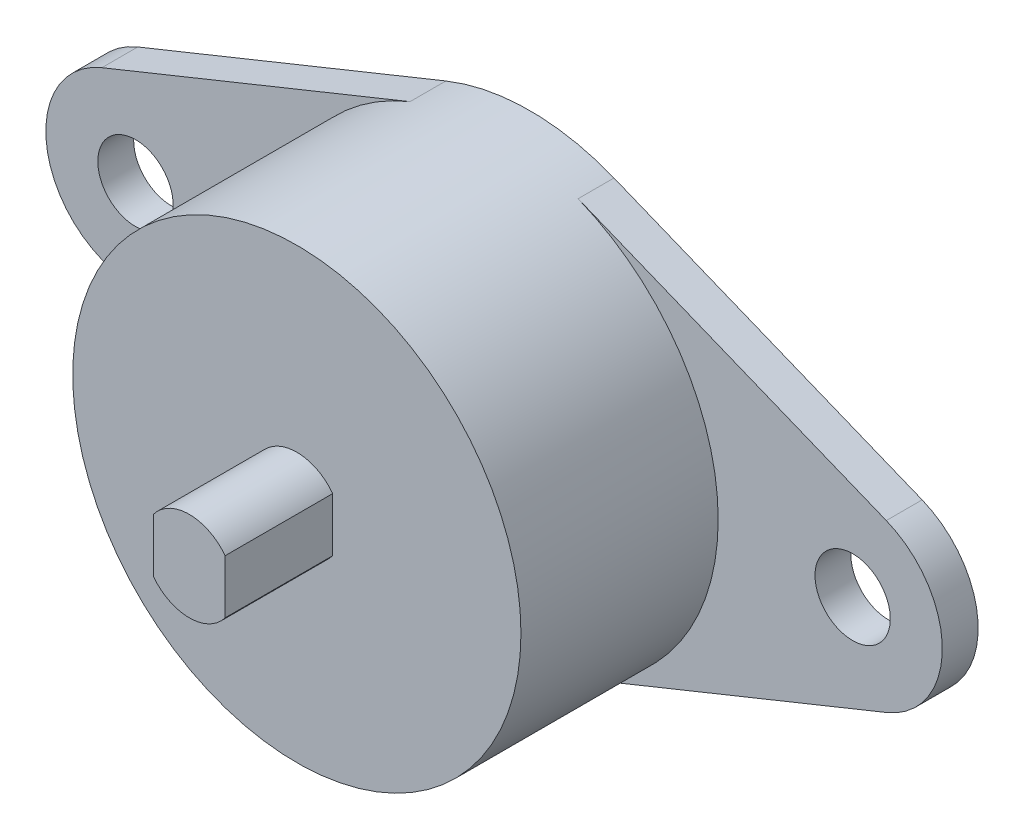
ISO-10303-21;
HEADER;
FILE_DESCRIPTION(('STEP AP214'),'2;1');
FILE_NAME('part.step','',(''),(''),'','','');
FILE_SCHEMA(('AUTOMOTIVE_DESIGN { 1 0 10303 214 1 1 1 1 }'));
ENDSEC;
DATA;
#1=APPLICATION_CONTEXT('core data for automotive mechanical design processes');
#2=APPLICATION_PROTOCOL_DEFINITION('international standard','automotive_design',2000,#1);
#3=PRODUCT_CONTEXT('',#1,'mechanical');
#4=PRODUCT('Part','Part','',(#3));
#5=PRODUCT_RELATED_PRODUCT_CATEGORY('part','',(#4));
#6=PRODUCT_DEFINITION_FORMATION('','',#4);
#7=PRODUCT_DEFINITION_CONTEXT('part definition',#1,'design');
#8=PRODUCT_DEFINITION('design','',#6,#7);
#9=PRODUCT_DEFINITION_SHAPE('','',#8);
#10=(LENGTH_UNIT() NAMED_UNIT(*) SI_UNIT(.MILLI.,.METRE.));
#11=(NAMED_UNIT(*) PLANE_ANGLE_UNIT() SI_UNIT($,.RADIAN.));
#12=(NAMED_UNIT(*) SI_UNIT($,.STERADIAN.) SOLID_ANGLE_UNIT());
#13=UNCERTAINTY_MEASURE_WITH_UNIT(LENGTH_MEASURE(1.E-05),#10,'distance_accuracy_value','');
#14=(GEOMETRIC_REPRESENTATION_CONTEXT(3) GLOBAL_UNCERTAINTY_ASSIGNED_CONTEXT((#13)) GLOBAL_UNIT_ASSIGNED_CONTEXT((#10,
#11,#12)) REPRESENTATION_CONTEXT('',''));
#15=CARTESIAN_POINT('',(0.,0.,0.));
#16=DIRECTION('',(0.,0.,1.));
#17=DIRECTION('',(1.,0.,0.));
#18=AXIS2_PLACEMENT_3D('',#15,#16,#17);
#19=CARTESIAN_POINT('',(0.,0.,19.));
#20=DIRECTION('',(0.,0.,-1.));
#21=DIRECTION('',(-1.,0.,0.));
#22=AXIS2_PLACEMENT_3D('',#19,#20,#21);
#23=PLANE('',#22);
#24=DIRECTION('',(0.,1.,0.));
#25=VECTOR('',#24,1.);
#26=CARTESIAN_POINT('',(-2.,1.50000000000003,19.));
#27=LINE('',#26,#25);
#28=CARTESIAN_POINT('',(-1.99999999999999,-1.50000000000001,19.));
#29=VERTEX_POINT('',#28);
#30=CARTESIAN_POINT('',(-1.99999999999999,1.50000000000001,19.));
#31=VERTEX_POINT('',#30);
#32=EDGE_CURVE('E119',#29,#31,#27,.T.);
#33=ORIENTED_EDGE('',*,*,#32,.F.);
#34=CARTESIAN_POINT('',(0.,0.,19.));
#35=DIRECTION('',(0.,0.,1.));
#36=DIRECTION('',(1.,0.,0.));
#37=AXIS2_PLACEMENT_3D('',#34,#35,#36);
#38=CIRCLE('',#37,2.5);
#39=CARTESIAN_POINT('',(1.99999999999999,-1.50000000000001,19.));
#40=VERTEX_POINT('',#39);
#41=EDGE_CURVE('E107',#40,#29,#38,.F.);
#42=ORIENTED_EDGE('',*,*,#41,.F.);
#43=DIRECTION('',(0.,1.,0.));
#44=VECTOR('',#43,1.);
#45=CARTESIAN_POINT('',(2.,-1.50000000000003,19.));
#46=LINE('',#45,#44);
#47=CARTESIAN_POINT('',(2.,1.50000000000001,19.));
#48=VERTEX_POINT('',#47);
#49=EDGE_CURVE('E105',#48,#40,#46,.F.);
#50=ORIENTED_EDGE('',*,*,#49,.F.);
#51=CARTESIAN_POINT('',(0.,0.,19.));
#52=DIRECTION('',(0.,0.,1.));
#53=DIRECTION('',(1.,0.,0.));
#54=AXIS2_PLACEMENT_3D('',#51,#52,#53);
#55=CIRCLE('',#54,2.5);
#56=EDGE_CURVE('E20',#31,#48,#55,.F.);
#57=ORIENTED_EDGE('',*,*,#56,.F.);
#58=EDGE_LOOP('',(#33,#42,#50,#57));
#59=FACE_BOUND('',#58,.T.);
#60=ADVANCED_FACE('F17',(#59),#23,.F.);
#61=CARTESIAN_POINT('',(-2.,1.50000000000003,13.));
#62=DIRECTION('',(-1.,0.,0.));
#63=DIRECTION('',(0.,0.,1.));
#64=AXIS2_PLACEMENT_3D('',#61,#62,#63);
#65=PLANE('',#64);
#66=DIRECTION('',(0.,1.,0.));
#67=VECTOR('',#66,1.);
#68=CARTESIAN_POINT('',(-2.,0.,13.));
#69=LINE('',#68,#67);
#70=CARTESIAN_POINT('',(-1.99999999999999,-1.50000000000001,13.));
#71=VERTEX_POINT('',#70);
#72=CARTESIAN_POINT('',(-1.99999999999999,1.50000000000001,13.));
#73=VERTEX_POINT('',#72);
#74=EDGE_CURVE('E180',#71,#73,#69,.T.);
#75=ORIENTED_EDGE('',*,*,#74,.F.);
#76=DIRECTION('',(0.,0.,1.));
#77=VECTOR('',#76,1.);
#78=CARTESIAN_POINT('',(-1.99999999999999,-1.50000000000002,13.));
#79=LINE('',#78,#77);
#80=EDGE_CURVE('E125',#29,#71,#79,.F.);
#81=ORIENTED_EDGE('',*,*,#80,.F.);
#82=ORIENTED_EDGE('',*,*,#32,.T.);
#83=DIRECTION('',(0.,0.,1.));
#84=VECTOR('',#83,1.);
#85=CARTESIAN_POINT('',(-1.99999999999999,1.50000000000002,13.));
#86=LINE('',#85,#84);
#87=EDGE_CURVE('E112',#73,#31,#86,.T.);
#88=ORIENTED_EDGE('',*,*,#87,.F.);
#89=EDGE_LOOP('',(#75,#81,#82,#88));
#90=FACE_BOUND('',#89,.T.);
#91=ADVANCED_FACE('F263',(#90),#65,.T.);
#92=CARTESIAN_POINT('',(0.,0.,13.));
#93=DIRECTION('',(0.,0.,1.));
#94=DIRECTION('',(1.,0.,0.));
#95=AXIS2_PLACEMENT_3D('',#92,#93,#94);
#96=CYLINDRICAL_SURFACE('',#95,2.5);
#97=CARTESIAN_POINT('',(0.,0.,13.));
#98=DIRECTION('',(0.,0.,1.));
#99=DIRECTION('',(1.,0.,0.));
#100=AXIS2_PLACEMENT_3D('',#97,#98,#99);
#101=CIRCLE('',#100,2.5);
#102=CARTESIAN_POINT('',(2.,1.50000000000001,13.));
#103=VERTEX_POINT('',#102);
#104=EDGE_CURVE('E179',#73,#103,#101,.F.);
#105=ORIENTED_EDGE('',*,*,#104,.F.);
#106=ORIENTED_EDGE('',*,*,#87,.T.);
#107=ORIENTED_EDGE('',*,*,#56,.T.);
#108=DIRECTION('',(0.,0.,-1.));
#109=VECTOR('',#108,1.);
#110=CARTESIAN_POINT('',(2.,1.50000000000003,13.));
#111=LINE('',#110,#109);
#112=EDGE_CURVE('E111',#103,#48,#111,.F.);
#113=ORIENTED_EDGE('',*,*,#112,.F.);
#114=EDGE_LOOP('',(#105,#106,#107,#113));
#115=FACE_BOUND('',#114,.T.);
#116=ADVANCED_FACE('F117',(#115),#96,.T.);
#117=CARTESIAN_POINT('',(2.,-1.50000000000003,13.));
#118=DIRECTION('',(1.,0.,0.));
#119=DIRECTION('',(0.,0.,-1.));
#120=AXIS2_PLACEMENT_3D('',#117,#118,#119);
#121=PLANE('',#120);
#122=DIRECTION('',(0.,1.,0.));
#123=VECTOR('',#122,1.);
#124=CARTESIAN_POINT('',(2.,0.,13.));
#125=LINE('',#124,#123);
#126=CARTESIAN_POINT('',(1.99999999999999,-1.50000000000001,13.));
#127=VERTEX_POINT('',#126);
#128=EDGE_CURVE('E122',#103,#127,#125,.F.);
#129=ORIENTED_EDGE('',*,*,#128,.F.);
#130=ORIENTED_EDGE('',*,*,#112,.T.);
#131=ORIENTED_EDGE('',*,*,#49,.T.);
#132=DIRECTION('',(0.,0.,1.));
#133=VECTOR('',#132,1.);
#134=CARTESIAN_POINT('',(1.99999999999999,-1.50000000000002,13.));
#135=LINE('',#134,#133);
#136=EDGE_CURVE('E128',#127,#40,#135,.T.);
#137=ORIENTED_EDGE('',*,*,#136,.F.);
#138=EDGE_LOOP('',(#129,#130,#131,#137));
#139=FACE_BOUND('',#138,.T.);
#140=ADVANCED_FACE('F120',(#139),#121,.T.);
#141=CARTESIAN_POINT('',(0.,0.,13.));
#142=DIRECTION('',(0.,0.,1.));
#143=DIRECTION('',(1.,0.,0.));
#144=AXIS2_PLACEMENT_3D('',#141,#142,#143);
#145=CYLINDRICAL_SURFACE('',#144,2.5);
#146=CARTESIAN_POINT('',(0.,0.,13.));
#147=DIRECTION('',(0.,0.,1.));
#148=DIRECTION('',(1.,0.,0.));
#149=AXIS2_PLACEMENT_3D('',#146,#147,#148);
#150=CIRCLE('',#149,2.5);
#151=EDGE_CURVE('E175',#127,#71,#150,.F.);
#152=ORIENTED_EDGE('',*,*,#151,.F.);
#153=ORIENTED_EDGE('',*,*,#136,.T.);
#154=ORIENTED_EDGE('',*,*,#41,.T.);
#155=ORIENTED_EDGE('',*,*,#80,.T.);
#156=EDGE_LOOP('',(#152,#153,#154,#155));
#157=FACE_BOUND('',#156,.T.);
#158=ADVANCED_FACE('F199',(#157),#145,.T.);
#159=CARTESIAN_POINT('',(20.,0.,0.));
#160=DIRECTION('',(0.,0.,1.));
#161=DIRECTION('',(1.,0.,0.));
#162=AXIS2_PLACEMENT_3D('',#159,#160,#161);
#163=CYLINDRICAL_SURFACE('',#162,4.99999999999999);
#164=CARTESIAN_POINT('',(20.,0.,2.));
#165=DIRECTION('',(0.,0.,1.));
#166=DIRECTION('',(1.,0.,0.));
#167=AXIS2_PLACEMENT_3D('',#164,#165,#166);
#168=CIRCLE('',#167,4.99999999999999);
#169=CARTESIAN_POINT('',(21.875,-4.63512405443479,2.));
#170=VERTEX_POINT('',#169);
#171=CARTESIAN_POINT('',(21.875,4.6351240544348,2.));
#172=VERTEX_POINT('',#171);
#173=EDGE_CURVE('E172',#170,#172,#168,.T.);
#174=ORIENTED_EDGE('',*,*,#173,.F.);
#175=DIRECTION('',(0.,0.,1.));
#176=VECTOR('',#175,1.);
#177=CARTESIAN_POINT('',(21.875,-4.63512405443478,0.));
#178=LINE('',#177,#176);
#179=CARTESIAN_POINT('',(21.875,-4.63512405443479,0.));
#180=VERTEX_POINT('',#179);
#181=EDGE_CURVE('E188',#180,#170,#178,.T.);
#182=ORIENTED_EDGE('',*,*,#181,.F.);
#183=CARTESIAN_POINT('',(20.,0.,0.));
#184=DIRECTION('',(0.,0.,1.));
#185=DIRECTION('',(1.,0.,0.));
#186=AXIS2_PLACEMENT_3D('',#183,#184,#185);
#187=CIRCLE('',#186,4.99999999999999);
#188=CARTESIAN_POINT('',(21.875,4.6351240544348,0.));
#189=VERTEX_POINT('',#188);
#190=EDGE_CURVE('E165',#180,#189,#187,.T.);
#191=ORIENTED_EDGE('',*,*,#190,.T.);
#192=DIRECTION('',(0.,0.,1.));
#193=VECTOR('',#192,1.);
#194=CARTESIAN_POINT('',(21.875,4.6351240544348,0.));
#195=LINE('',#194,#193);
#196=EDGE_CURVE('E191',#172,#189,#195,.F.);
#197=ORIENTED_EDGE('',*,*,#196,.F.);
#198=EDGE_LOOP('',(#174,#182,#191,#197));
#199=FACE_BOUND('',#198,.T.);
#200=ADVANCED_FACE('F253',(#199),#163,.T.);
#201=CARTESIAN_POINT('',(20.,0.,0.899999999999999));
#202=DIRECTION('',(0.,0.,-1.));
#203=DIRECTION('',(-1.,0.,0.));
#204=AXIS2_PLACEMENT_3D('',#201,#202,#203);
#205=CYLINDRICAL_SURFACE('',#204,2.1);
#206=CARTESIAN_POINT('',(20.,0.,0.));
#207=DIRECTION('',(0.,0.,-1.));
#208=DIRECTION('',(-1.,0.,0.));
#209=AXIS2_PLACEMENT_3D('',#206,#207,#208);
#210=CIRCLE('',#209,2.1);
#211=CARTESIAN_POINT('',(17.9,0.,0.));
#212=VERTEX_POINT('',#211);
#213=EDGE_CURVE('E154',#212,#212,#210,.T.);
#214=ORIENTED_EDGE('',*,*,#213,.T.);
#215=EDGE_LOOP('',(#214));
#216=FACE_BOUND('',#215,.T.);
#217=CARTESIAN_POINT('',(20.,0.,2.));
#218=DIRECTION('',(0.,0.,-1.));
#219=DIRECTION('',(-1.,0.,0.));
#220=AXIS2_PLACEMENT_3D('',#217,#218,#219);
#221=CIRCLE('',#220,2.1);
#222=CARTESIAN_POINT('',(17.9,0.,2.));
#223=VERTEX_POINT('',#222);
#224=EDGE_CURVE('E168',#223,#223,#221,.T.);
#225=ORIENTED_EDGE('',*,*,#224,.F.);
#226=EDGE_LOOP('',(#225));
#227=FACE_BOUND('',#226,.T.);
#228=ADVANCED_FACE('F249',(#216,#227),#205,.F.);
#229=CARTESIAN_POINT('',(-20.,0.,0.));
#230=DIRECTION('',(0.,0.,1.));
#231=DIRECTION('',(1.,0.,0.));
#232=AXIS2_PLACEMENT_3D('',#229,#230,#231);
#233=CYLINDRICAL_SURFACE('',#232,4.99999999999999);
#234=CARTESIAN_POINT('',(-20.,0.,2.));
#235=DIRECTION('',(0.,0.,1.));
#236=DIRECTION('',(1.,0.,0.));
#237=AXIS2_PLACEMENT_3D('',#234,#235,#236);
#238=CIRCLE('',#237,4.99999999999999);
#239=CARTESIAN_POINT('',(-21.875,4.63512405443479,2.));
#240=VERTEX_POINT('',#239);
#241=CARTESIAN_POINT('',(-21.875,-4.63512405443477,2.));
#242=VERTEX_POINT('',#241);
#243=EDGE_CURVE('E151',#240,#242,#238,.T.);
#244=ORIENTED_EDGE('',*,*,#243,.F.);
#245=DIRECTION('',(0.,0.,1.));
#246=VECTOR('',#245,1.);
#247=CARTESIAN_POINT('',(-21.875,4.63512405443478,0.));
#248=LINE('',#247,#246);
#249=CARTESIAN_POINT('',(-21.875,4.63512405443478,0.));
#250=VERTEX_POINT('',#249);
#251=EDGE_CURVE('E189',#250,#240,#248,.T.);
#252=ORIENTED_EDGE('',*,*,#251,.F.);
#253=CARTESIAN_POINT('',(-20.,0.,0.));
#254=DIRECTION('',(0.,0.,1.));
#255=DIRECTION('',(1.,0.,0.));
#256=AXIS2_PLACEMENT_3D('',#253,#254,#255);
#257=CIRCLE('',#256,4.99999999999999);
#258=CARTESIAN_POINT('',(-21.875,-4.63512405443477,0.));
#259=VERTEX_POINT('',#258);
#260=EDGE_CURVE('E161',#250,#259,#257,.T.);
#261=ORIENTED_EDGE('',*,*,#260,.T.);
#262=DIRECTION('',(0.,0.,1.));
#263=VECTOR('',#262,1.);
#264=CARTESIAN_POINT('',(-21.875,-4.63512405443477,0.));
#265=LINE('',#264,#263);
#266=EDGE_CURVE('E178',#242,#259,#265,.F.);
#267=ORIENTED_EDGE('',*,*,#266,.F.);
#268=EDGE_LOOP('',(#244,#252,#261,#267));
#269=FACE_BOUND('',#268,.T.);
#270=ADVANCED_FACE('F245',(#269),#233,.T.);
#271=CARTESIAN_POINT('',(-20.,0.,0.899999999999999));
#272=DIRECTION('',(0.,0.,-1.));
#273=DIRECTION('',(-1.,0.,0.));
#274=AXIS2_PLACEMENT_3D('',#271,#272,#273);
#275=CYLINDRICAL_SURFACE('',#274,2.1);
#276=CARTESIAN_POINT('',(-20.,0.,0.));
#277=DIRECTION('',(0.,0.,-1.));
#278=DIRECTION('',(-1.,0.,0.));
#279=AXIS2_PLACEMENT_3D('',#276,#277,#278);
#280=CIRCLE('',#279,2.1);
#281=CARTESIAN_POINT('',(-22.1,0.,0.));
#282=VERTEX_POINT('',#281);
#283=EDGE_CURVE('E158',#282,#282,#280,.T.);
#284=ORIENTED_EDGE('',*,*,#283,.T.);
#285=EDGE_LOOP('',(#284));
#286=FACE_BOUND('',#285,.T.);
#287=CARTESIAN_POINT('',(-20.,0.,2.));
#288=DIRECTION('',(0.,0.,-1.));
#289=DIRECTION('',(-1.,0.,0.));
#290=AXIS2_PLACEMENT_3D('',#287,#288,#289);
#291=CIRCLE('',#290,2.1);
#292=CARTESIAN_POINT('',(-22.1,0.,2.));
#293=VERTEX_POINT('',#292);
#294=EDGE_CURVE('E147',#293,#293,#291,.T.);
#295=ORIENTED_EDGE('',*,*,#294,.F.);
#296=EDGE_LOOP('',(#295));
#297=FACE_BOUND('',#296,.T.);
#298=ADVANCED_FACE('F205',(#286,#297),#275,.F.);
#299=CARTESIAN_POINT('',(0.,0.,13.));
#300=DIRECTION('',(0.,0.,1.));
#301=DIRECTION('',(1.,0.,0.));
#302=AXIS2_PLACEMENT_3D('',#299,#300,#301);
#303=PLANE('',#302);
#304=ORIENTED_EDGE('',*,*,#128,.T.);
#305=ORIENTED_EDGE('',*,*,#151,.T.);
#306=ORIENTED_EDGE('',*,*,#74,.T.);
#307=ORIENTED_EDGE('',*,*,#104,.T.);
#308=EDGE_LOOP('',(#304,#305,#306,#307));
#309=FACE_BOUND('',#308,.T.);
#310=CARTESIAN_POINT('',(0.,0.,13.));
#311=DIRECTION('',(0.,0.,1.));
#312=DIRECTION('',(1.,0.,0.));
#313=AXIS2_PLACEMENT_3D('',#310,#311,#312);
#314=CIRCLE('',#313,12.5);
#315=CARTESIAN_POINT('',(12.5,0.,13.));
#316=VERTEX_POINT('',#315);
#317=EDGE_CURVE('E144',#316,#316,#314,.F.);
#318=ORIENTED_EDGE('',*,*,#317,.F.);
#319=EDGE_LOOP('',(#318));
#320=FACE_BOUND('',#319,.T.);
#321=ADVANCED_FACE('F201',(#309,#320),#303,.T.);
#322=CARTESIAN_POINT('',(-21.875,-4.63512405443477,0.));
#323=DIRECTION('',(-0.375,-0.927024810886958,0.));
#324=DIRECTION('',(0.927024810886958,-0.375,0.));
#325=AXIS2_PLACEMENT_3D('',#322,#323,#324);
#326=PLANE('',#325);
#327=DIRECTION('',(0.927024810886958,-0.375,0.));
#328=VECTOR('',#327,1.);
#329=CARTESIAN_POINT('',(-21.875,-4.63512405443477,2.));
#330=LINE('',#329,#328);
#331=CARTESIAN_POINT('',(-4.6875,-11.587810136087,2.));
#332=VERTEX_POINT('',#331);
#333=EDGE_CURVE('E150',#242,#332,#330,.T.);
#334=ORIENTED_EDGE('',*,*,#333,.F.);
#335=ORIENTED_EDGE('',*,*,#266,.T.);
#336=DIRECTION('',(0.927024810886958,-0.375,0.));
#337=VECTOR('',#336,1.);
#338=CARTESIAN_POINT('',(-21.875,-4.63512405443477,0.));
#339=LINE('',#338,#337);
#340=CARTESIAN_POINT('',(-4.6875,-11.587810136087,0.));
#341=VERTEX_POINT('',#340);
#342=EDGE_CURVE('E194',#259,#341,#339,.T.);
#343=ORIENTED_EDGE('',*,*,#342,.T.);
#344=DIRECTION('',(0.,0.,1.));
#345=VECTOR('',#344,1.);
#346=CARTESIAN_POINT('',(-4.68750000000001,-11.587810136087,0.));
#347=LINE('',#346,#345);
#348=EDGE_CURVE('E143',#332,#341,#347,.F.);
#349=ORIENTED_EDGE('',*,*,#348,.F.);
#350=EDGE_LOOP('',(#334,#335,#343,#349));
#351=FACE_BOUND('',#350,.T.);
#352=ADVANCED_FACE('F204',(#351),#326,.T.);
#353=CARTESIAN_POINT('',(4.68749999999999,-11.587810136087,0.));
#354=DIRECTION('',(0.375,-0.927024810886958,0.));
#355=DIRECTION('',(0.927024810886958,0.375,0.));
#356=AXIS2_PLACEMENT_3D('',#353,#354,#355);
#357=PLANE('',#356);
#358=DIRECTION('',(0.927024810886958,0.374999999999999,0.));
#359=VECTOR('',#358,1.);
#360=CARTESIAN_POINT('',(4.68749999999999,-11.587810136087,2.));
#361=LINE('',#360,#359);
#362=CARTESIAN_POINT('',(4.6875,-11.587810136087,2.));
#363=VERTEX_POINT('',#362);
#364=EDGE_CURVE('E174',#363,#170,#361,.T.);
#365=ORIENTED_EDGE('',*,*,#364,.F.);
#366=DIRECTION('',(0.,0.,1.));
#367=VECTOR('',#366,1.);
#368=CARTESIAN_POINT('',(4.6875,-11.587810136087,0.));
#369=LINE('',#368,#367);
#370=CARTESIAN_POINT('',(4.6875,-11.587810136087,0.));
#371=VERTEX_POINT('',#370);
#372=EDGE_CURVE('E139',#371,#363,#369,.T.);
#373=ORIENTED_EDGE('',*,*,#372,.F.);
#374=DIRECTION('',(0.927024810886958,0.374999999999999,0.));
#375=VECTOR('',#374,1.);
#376=CARTESIAN_POINT('',(4.68749999999999,-11.587810136087,0.));
#377=LINE('',#376,#375);
#378=EDGE_CURVE('E167',#371,#180,#377,.T.);
#379=ORIENTED_EDGE('',*,*,#378,.T.);
#380=ORIENTED_EDGE('',*,*,#181,.T.);
#381=EDGE_LOOP('',(#365,#373,#379,#380));
#382=FACE_BOUND('',#381,.T.);
#383=ADVANCED_FACE('F235',(#382),#357,.T.);
#384=CARTESIAN_POINT('',(0.,0.,2.));
#385=DIRECTION('',(0.,0.,1.));
#386=DIRECTION('',(1.,0.,0.));
#387=AXIS2_PLACEMENT_3D('',#384,#385,#386);
#388=PLANE('',#387);
#389=ORIENTED_EDGE('',*,*,#224,.T.);
#390=EDGE_LOOP('',(#389));
#391=FACE_BOUND('',#390,.T.);
#392=ORIENTED_EDGE('',*,*,#173,.T.);
#393=DIRECTION('',(-0.927024810886958,0.375,0.));
#394=VECTOR('',#393,1.);
#395=CARTESIAN_POINT('',(21.875,4.6351240544348,2.));
#396=LINE('',#395,#394);
#397=CARTESIAN_POINT('',(4.68750000000001,11.587810136087,2.));
#398=VERTEX_POINT('',#397);
#399=EDGE_CURVE('E171',#398,#172,#396,.F.);
#400=ORIENTED_EDGE('',*,*,#399,.F.);
#401=CARTESIAN_POINT('',(0.,0.,2.));
#402=DIRECTION('',(0.,0.,1.));
#403=DIRECTION('',(1.,0.,0.));
#404=AXIS2_PLACEMENT_3D('',#401,#402,#403);
#405=CIRCLE('',#404,12.5);
#406=EDGE_CURVE('E136',#363,#398,#405,.T.);
#407=ORIENTED_EDGE('',*,*,#406,.F.);
#408=ORIENTED_EDGE('',*,*,#364,.T.);
#409=EDGE_LOOP('',(#392,#400,#407,#408));
#410=FACE_BOUND('',#409,.T.);
#411=ADVANCED_FACE('F231',(#391,#410),#388,.T.);
#412=CARTESIAN_POINT('',(21.875,4.6351240544348,0.));
#413=DIRECTION('',(0.375,0.927024810886958,0.));
#414=DIRECTION('',(-0.927024810886958,0.375,0.));
#415=AXIS2_PLACEMENT_3D('',#412,#413,#414);
#416=PLANE('',#415);
#417=ORIENTED_EDGE('',*,*,#399,.T.);
#418=ORIENTED_EDGE('',*,*,#196,.T.);
#419=DIRECTION('',(-0.927024810886958,0.374999999999999,0.));
#420=VECTOR('',#419,1.);
#421=CARTESIAN_POINT('',(21.875,4.6351240544348,0.));
#422=LINE('',#421,#420);
#423=CARTESIAN_POINT('',(4.68750000000001,11.587810136087,0.));
#424=VERTEX_POINT('',#423);
#425=EDGE_CURVE('E164',#189,#424,#422,.T.);
#426=ORIENTED_EDGE('',*,*,#425,.T.);
#427=DIRECTION('',(0.,0.,1.));
#428=VECTOR('',#427,1.);
#429=CARTESIAN_POINT('',(4.68750000000002,11.587810136087,0.));
#430=LINE('',#429,#428);
#431=EDGE_CURVE('E135',#398,#424,#430,.F.);
#432=ORIENTED_EDGE('',*,*,#431,.F.);
#433=EDGE_LOOP('',(#417,#418,#426,#432));
#434=FACE_BOUND('',#433,.T.);
#435=ADVANCED_FACE('F227',(#434),#416,.T.);
#436=CARTESIAN_POINT('',(0.,0.,0.));
#437=DIRECTION('',(0.,0.,1.));
#438=DIRECTION('',(1.,0.,0.));
#439=AXIS2_PLACEMENT_3D('',#436,#437,#438);
#440=PLANE('',#439);
#441=ORIENTED_EDGE('',*,*,#213,.F.);
#442=EDGE_LOOP('',(#441));
#443=FACE_BOUND('',#442,.T.);
#444=ORIENTED_EDGE('',*,*,#283,.F.);
#445=EDGE_LOOP('',(#444));
#446=FACE_BOUND('',#445,.T.);
#447=DIRECTION('',(-0.927024810886958,-0.375,0.));
#448=VECTOR('',#447,1.);
#449=CARTESIAN_POINT('',(-4.68749999999999,11.587810136087,0.));
#450=LINE('',#449,#448);
#451=CARTESIAN_POINT('',(-4.6875,11.587810136087,0.));
#452=VERTEX_POINT('',#451);
#453=EDGE_CURVE('E157',#452,#250,#450,.T.);
#454=ORIENTED_EDGE('',*,*,#453,.F.);
#455=CARTESIAN_POINT('',(0.,0.,0.));
#456=DIRECTION('',(0.,0.,1.));
#457=DIRECTION('',(1.,0.,0.));
#458=AXIS2_PLACEMENT_3D('',#455,#456,#457);
#459=CIRCLE('',#458,12.5);
#460=EDGE_CURVE('E132',#424,#452,#459,.T.);
#461=ORIENTED_EDGE('',*,*,#460,.F.);
#462=ORIENTED_EDGE('',*,*,#425,.F.);
#463=ORIENTED_EDGE('',*,*,#190,.F.);
#464=ORIENTED_EDGE('',*,*,#378,.F.);
#465=CARTESIAN_POINT('',(0.,0.,0.));
#466=DIRECTION('',(0.,0.,1.));
#467=DIRECTION('',(1.,0.,0.));
#468=AXIS2_PLACEMENT_3D('',#465,#466,#467);
#469=CIRCLE('',#468,12.5);
#470=EDGE_CURVE('E140',#341,#371,#469,.T.);
#471=ORIENTED_EDGE('',*,*,#470,.F.);
#472=ORIENTED_EDGE('',*,*,#342,.F.);
#473=ORIENTED_EDGE('',*,*,#260,.F.);
#474=EDGE_LOOP('',(#454,#461,#462,#463,#464,#471,#472,#473));
#475=FACE_BOUND('',#474,.T.);
#476=ADVANCED_FACE('F224',(#443,#446,#475),#440,.F.);
#477=CARTESIAN_POINT('',(-4.68749999999999,11.587810136087,0.));
#478=DIRECTION('',(-0.375,0.927024810886958,0.));
#479=DIRECTION('',(-0.927024810886958,-0.375,0.));
#480=AXIS2_PLACEMENT_3D('',#477,#478,#479);
#481=PLANE('',#480);
#482=DIRECTION('',(-0.927024810886958,-0.374999999999999,0.));
#483=VECTOR('',#482,1.);
#484=CARTESIAN_POINT('',(-4.68749999999999,11.587810136087,2.));
#485=LINE('',#484,#483);
#486=CARTESIAN_POINT('',(-4.6875,11.587810136087,2.));
#487=VERTEX_POINT('',#486);
#488=EDGE_CURVE('E35',#487,#240,#485,.T.);
#489=ORIENTED_EDGE('',*,*,#488,.F.);
#490=DIRECTION('',(0.,0.,1.));
#491=VECTOR('',#490,1.);
#492=CARTESIAN_POINT('',(-4.6875,11.587810136087,0.));
#493=LINE('',#492,#491);
#494=EDGE_CURVE('E26',#452,#487,#493,.T.);
#495=ORIENTED_EDGE('',*,*,#494,.F.);
#496=ORIENTED_EDGE('',*,*,#453,.T.);
#497=ORIENTED_EDGE('',*,*,#251,.T.);
#498=EDGE_LOOP('',(#489,#495,#496,#497));
#499=FACE_BOUND('',#498,.T.);
#500=ADVANCED_FACE('F218',(#499),#481,.T.);
#501=CARTESIAN_POINT('',(0.,0.,2.));
#502=DIRECTION('',(0.,0.,1.));
#503=DIRECTION('',(1.,0.,0.));
#504=AXIS2_PLACEMENT_3D('',#501,#502,#503);
#505=PLANE('',#504);
#506=ORIENTED_EDGE('',*,*,#294,.T.);
#507=EDGE_LOOP('',(#506));
#508=FACE_BOUND('',#507,.T.);
#509=ORIENTED_EDGE('',*,*,#243,.T.);
#510=ORIENTED_EDGE('',*,*,#333,.T.);
#511=CARTESIAN_POINT('',(0.,0.,2.));
#512=DIRECTION('',(0.,0.,1.));
#513=DIRECTION('',(1.,0.,0.));
#514=AXIS2_PLACEMENT_3D('',#511,#512,#513);
#515=CIRCLE('',#514,12.5);
#516=EDGE_CURVE('E11',#487,#332,#515,.T.);
#517=ORIENTED_EDGE('',*,*,#516,.F.);
#518=ORIENTED_EDGE('',*,*,#488,.T.);
#519=EDGE_LOOP('',(#509,#510,#517,#518));
#520=FACE_BOUND('',#519,.T.);
#521=ADVANCED_FACE('F211',(#508,#520),#505,.T.);
#522=CARTESIAN_POINT('',(0.,0.,0.));
#523=DIRECTION('',(0.,0.,1.));
#524=DIRECTION('',(1.,0.,0.));
#525=AXIS2_PLACEMENT_3D('',#522,#523,#524);
#526=CYLINDRICAL_SURFACE('',#525,12.5);
#527=ORIENTED_EDGE('',*,*,#516,.T.);
#528=ORIENTED_EDGE('',*,*,#348,.T.);
#529=ORIENTED_EDGE('',*,*,#470,.T.);
#530=ORIENTED_EDGE('',*,*,#372,.T.);
#531=ORIENTED_EDGE('',*,*,#406,.T.);
#532=ORIENTED_EDGE('',*,*,#431,.T.);
#533=ORIENTED_EDGE('',*,*,#460,.T.);
#534=ORIENTED_EDGE('',*,*,#494,.T.);
#535=EDGE_LOOP('',(#527,#528,#529,#530,#531,#532,#533,#534));
#536=FACE_BOUND('',#535,.T.);
#537=ORIENTED_EDGE('',*,*,#317,.T.);
#538=EDGE_LOOP('',(#537));
#539=FACE_BOUND('',#538,.T.);
#540=ADVANCED_FACE('F209',(#536,#539),#526,.T.);
#541=CLOSED_SHELL('',(#60,#91,#116,#140,#158,#200,#228,#270,#298,#321,#352,#383,#411,#435,#476,
#500,#521,#540));
#542=MANIFOLD_SOLID_BREP('B1',#541);
#543=ADVANCED_BREP_SHAPE_REPRESENTATION('',(#18,#542),#14);
#544=SHAPE_DEFINITION_REPRESENTATION(#9,#543);
ENDSEC;
END-ISO-10303-21;
